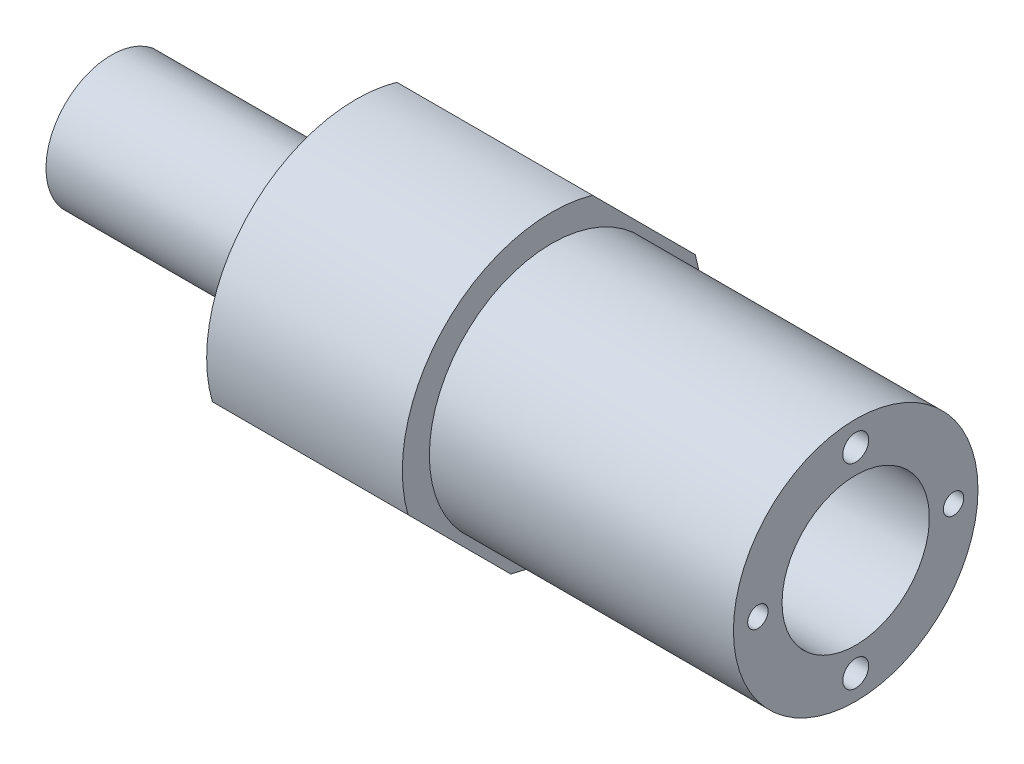
ISO-10303-21;
HEADER;
FILE_DESCRIPTION(('STEP AP214'),'2;1');
FILE_NAME('part.step','',(''),(''),'','','');
FILE_SCHEMA(('AUTOMOTIVE_DESIGN { 1 0 10303 214 1 1 1 1 }'));
ENDSEC;
DATA;
#1=APPLICATION_CONTEXT('core data for automotive mechanical design processes');
#2=APPLICATION_PROTOCOL_DEFINITION('international standard','automotive_design',2000,#1);
#3=PRODUCT_CONTEXT('',#1,'mechanical');
#4=PRODUCT('Part','Part','',(#3));
#5=PRODUCT_RELATED_PRODUCT_CATEGORY('part','',(#4));
#6=PRODUCT_DEFINITION_FORMATION('','',#4);
#7=PRODUCT_DEFINITION_CONTEXT('part definition',#1,'design');
#8=PRODUCT_DEFINITION('design','',#6,#7);
#9=PRODUCT_DEFINITION_SHAPE('','',#8);
#10=(LENGTH_UNIT() NAMED_UNIT(*) SI_UNIT(.MILLI.,.METRE.));
#11=(NAMED_UNIT(*) PLANE_ANGLE_UNIT() SI_UNIT($,.RADIAN.));
#12=(NAMED_UNIT(*) SI_UNIT($,.STERADIAN.) SOLID_ANGLE_UNIT());
#13=UNCERTAINTY_MEASURE_WITH_UNIT(LENGTH_MEASURE(1.E-05),#10,'distance_accuracy_value','');
#14=(GEOMETRIC_REPRESENTATION_CONTEXT(3) GLOBAL_UNCERTAINTY_ASSIGNED_CONTEXT((#13)) GLOBAL_UNIT_ASSIGNED_CONTEXT((#10,
#11,#12)) REPRESENTATION_CONTEXT('',''));
#15=CARTESIAN_POINT('',(0.,0.,0.));
#16=DIRECTION('',(0.,0.,1.));
#17=DIRECTION('',(1.,0.,0.));
#18=AXIS2_PLACEMENT_3D('',#15,#16,#17);
#19=CARTESIAN_POINT('',(227.370475165962,-148.573704322227,0.));
#20=DIRECTION('',(-1.,0.,0.));
#21=DIRECTION('',(0.,0.,1.));
#22=AXIS2_PLACEMENT_3D('',#19,#20,#21);
#23=CYLINDRICAL_SURFACE('',#22,18.3167356680549);
#24=DIRECTION('',(-1.,0.,0.));
#25=VECTOR('',#24,1.);
#26=CARTESIAN_POINT('',(227.370475165962,-130.955124471129,-5.00883714687244));
#27=LINE('',#26,#25);
#28=CARTESIAN_POINT('',(197.978559984911,-130.955124471129,-5.00883714687246));
#29=VERTEX_POINT('',#28);
#30=CARTESIAN_POINT('',(221.978559984911,-130.955124471129,-5.00883714687248));
#31=VERTEX_POINT('',#30);
#32=EDGE_CURVE('E11',#29,#31,#27,.F.);
#33=ORIENTED_EDGE('',*,*,#32,.F.);
#34=CARTESIAN_POINT('',(197.978559984911,-148.573704322227,0.));
#35=DIRECTION('',(-1.,0.,0.));
#36=DIRECTION('',(0.,0.,1.));
#37=AXIS2_PLACEMENT_3D('',#34,#35,#36);
#38=CIRCLE('',#37,18.3167356680549);
#39=CARTESIAN_POINT('',(197.978559984911,-153.582541469098,17.6185798510982));
#40=VERTEX_POINT('',#39);
#41=EDGE_CURVE('E174',#40,#29,#38,.T.);
#42=ORIENTED_EDGE('',*,*,#41,.F.);
#43=DIRECTION('',(-1.,0.,0.));
#44=VECTOR('',#43,1.);
#45=CARTESIAN_POINT('',(227.370475165962,-153.582541469098,17.6185798510982));
#46=LINE('',#45,#44);
#47=CARTESIAN_POINT('',(221.978559984911,-153.582541469098,17.6185798510982));
#48=VERTEX_POINT('',#47);
#49=EDGE_CURVE('E153',#48,#40,#46,.T.);
#50=ORIENTED_EDGE('',*,*,#49,.F.);
#51=CARTESIAN_POINT('',(221.978559984911,-148.573704322227,0.));
#52=DIRECTION('',(-1.,0.,0.));
#53=DIRECTION('',(0.,0.,1.));
#54=AXIS2_PLACEMENT_3D('',#51,#52,#53);
#55=CIRCLE('',#54,18.3167356680549);
#56=EDGE_CURVE('E180',#48,#31,#55,.T.);
#57=ORIENTED_EDGE('',*,*,#56,.T.);
#58=EDGE_LOOP('',(#33,#42,#50,#57));
#59=FACE_BOUND('',#58,.T.);
#60=ADVANCED_FACE('F35',(#59),#23,.T.);
#61=CARTESIAN_POINT('',(197.978559984911,0.,0.));
#62=DIRECTION('',(1.,0.,0.));
#63=DIRECTION('',(0.,0.,-1.));
#64=AXIS2_PLACEMENT_3D('',#61,#62,#63);
#65=PLANE('',#64);
#66=CARTESIAN_POINT('',(197.978559984911,-148.573704322227,-12.));
#67=DIRECTION('',(-1.,0.,0.));
#68=DIRECTION('',(0.,0.,1.));
#69=AXIS2_PLACEMENT_3D('',#66,#67,#68);
#70=CIRCLE('',#69,1.64999999999998);
#71=CARTESIAN_POINT('',(197.978559984911,-148.573704322227,-10.35));
#72=VERTEX_POINT('',#71);
#73=EDGE_CURVE('E245',#72,#72,#70,.T.);
#74=ORIENTED_EDGE('',*,*,#73,.F.);
#75=EDGE_LOOP('',(#74));
#76=FACE_BOUND('',#75,.T.);
#77=CARTESIAN_POINT('',(197.978559984911,-148.573704322227,12.));
#78=DIRECTION('',(-1.,0.,0.));
#79=DIRECTION('',(0.,0.,1.));
#80=AXIS2_PLACEMENT_3D('',#77,#78,#79);
#81=CIRCLE('',#80,1.64999999999998);
#82=CARTESIAN_POINT('',(197.978559984911,-148.573704322227,13.65));
#83=VERTEX_POINT('',#82);
#84=EDGE_CURVE('E262',#83,#83,#81,.T.);
#85=ORIENTED_EDGE('',*,*,#84,.F.);
#86=EDGE_LOOP('',(#85));
#87=FACE_BOUND('',#86,.T.);
#88=CARTESIAN_POINT('',(197.978559984911,-136.573704322227,0.));
#89=DIRECTION('',(1.,0.,0.));
#90=DIRECTION('',(0.,0.,-1.));
#91=AXIS2_PLACEMENT_3D('',#88,#89,#90);
#92=CIRCLE('',#91,1.5875);
#93=CARTESIAN_POINT('',(197.978559984911,-136.573704322227,-1.5875));
#94=VERTEX_POINT('',#93);
#95=EDGE_CURVE('E185',#94,#94,#92,.F.);
#96=ORIENTED_EDGE('',*,*,#95,.F.);
#97=EDGE_LOOP('',(#96));
#98=FACE_BOUND('',#97,.T.);
#99=CARTESIAN_POINT('',(197.978559984911,-160.573704322227,0.));
#100=DIRECTION('',(1.,0.,0.));
#101=DIRECTION('',(0.,0.,-1.));
#102=AXIS2_PLACEMENT_3D('',#99,#100,#101);
#103=CIRCLE('',#102,1.5875);
#104=CARTESIAN_POINT('',(197.978559984911,-160.573704322227,-1.5875));
#105=VERTEX_POINT('',#104);
#106=EDGE_CURVE('E187',#105,#105,#103,.F.);
#107=ORIENTED_EDGE('',*,*,#106,.F.);
#108=EDGE_LOOP('',(#107));
#109=FACE_BOUND('',#108,.T.);
#110=CARTESIAN_POINT('',(197.978559984911,-148.573704322227,0.));
#111=DIRECTION('',(-1.,0.,0.));
#112=DIRECTION('',(0.,0.,1.));
#113=AXIS2_PLACEMENT_3D('',#110,#111,#112);
#114=CIRCLE('',#113,8.02619764601481);
#115=CARTESIAN_POINT('',(197.978559984911,-143.488608741499,-6.20980286222918));
#116=VERTEX_POINT('',#115);
#117=CARTESIAN_POINT('',(197.978559984911,-142.363901459998,-5.08509558072846));
#118=VERTEX_POINT('',#117);
#119=EDGE_CURVE('E150',#116,#118,#114,.T.);
#120=ORIENTED_EDGE('',*,*,#119,.F.);
#121=CARTESIAN_POINT('',(197.978559984911,-142.987560750853,-5.58614357137373));
#122=DIRECTION('',(1.,0.,0.));
#123=DIRECTION('',(0.,0.,-1.));
#124=AXIS2_PLACEMENT_3D('',#121,#122,#123);
#125=CIRCLE('',#124,0.799999999999998);
#126=EDGE_CURVE('E294',#118,#116,#125,.F.);
#127=ORIENTED_EDGE('',*,*,#126,.F.);
#128=EDGE_LOOP('',(#120,#127));
#129=FACE_BOUND('',#128,.T.);
#130=ORIENTED_EDGE('',*,*,#41,.T.);
#131=DIRECTION('',(0.,0.707106781186583,0.707106781186511));
#132=VECTOR('',#131,1.);
#133=CARTESIAN_POINT('',(197.978559984911,-127.583420636013,-1.63713331175623));
#134=LINE('',#133,#132);
#135=CARTESIAN_POINT('',(197.978559984911,-143.564867175356,-17.6185798510982));
#136=VERTEX_POINT('',#135);
#137=EDGE_CURVE('E160',#136,#29,#134,.T.);
#138=ORIENTED_EDGE('',*,*,#137,.F.);
#139=CARTESIAN_POINT('',(197.978559984911,-166.192284173325,5.00883714687249));
#140=VERTEX_POINT('',#139);
#141=EDGE_CURVE('E172',#136,#140,#38,.T.);
#142=ORIENTED_EDGE('',*,*,#141,.T.);
#143=DIRECTION('',(0.,-0.707106781186583,-0.707106781186511));
#144=VECTOR('',#143,1.);
#145=CARTESIAN_POINT('',(197.978559984911,-147.131312046921,24.0698092732747));
#146=LINE('',#145,#144);
#147=EDGE_CURVE('E176',#40,#140,#146,.T.);
#148=ORIENTED_EDGE('',*,*,#147,.F.);
#149=EDGE_LOOP('',(#130,#138,#142,#148));
#150=FACE_BOUND('',#149,.T.);
#151=ADVANCED_FACE('F37',(#76,#87,#98,#109,#129,#150),#65,.F.);
#152=CARTESIAN_POINT('',(227.370475165962,-148.573704322227,0.));
#153=DIRECTION('',(-1.,0.,0.));
#154=DIRECTION('',(0.,0.,1.));
#155=AXIS2_PLACEMENT_3D('',#152,#153,#154);
#156=CYLINDRICAL_SURFACE('',#155,8.02619764601481);
#157=CARTESIAN_POINT('',(167.978559984911,-148.573704322227,0.));
#158=DIRECTION('',(-1.,0.,0.));
#159=DIRECTION('',(0.,0.,1.));
#160=AXIS2_PLACEMENT_3D('',#157,#158,#159);
#161=CIRCLE('',#160,8.02619764601481);
#162=CARTESIAN_POINT('',(167.978559984911,-143.488608741499,-6.20980286222918));
#163=VERTEX_POINT('',#162);
#164=CARTESIAN_POINT('',(167.978559984911,-142.363901459998,-5.08509558072844));
#165=VERTEX_POINT('',#164);
#166=EDGE_CURVE('E147',#163,#165,#161,.T.);
#167=ORIENTED_EDGE('',*,*,#166,.F.);
#168=DIRECTION('',(-1.,0.,0.));
#169=VECTOR('',#168,1.);
#170=CARTESIAN_POINT('',(182.978559984911,-143.488608741499,-6.20980286222918));
#171=LINE('',#170,#169);
#172=EDGE_CURVE('E50',#116,#163,#171,.T.);
#173=ORIENTED_EDGE('',*,*,#172,.F.);
#174=ORIENTED_EDGE('',*,*,#119,.T.);
#175=DIRECTION('',(-1.,0.,0.));
#176=VECTOR('',#175,1.);
#177=CARTESIAN_POINT('',(182.978559984911,-142.363901459998,-5.08509558072846));
#178=LINE('',#177,#176);
#179=EDGE_CURVE('E298',#165,#118,#178,.F.);
#180=ORIENTED_EDGE('',*,*,#179,.F.);
#181=EDGE_LOOP('',(#167,#173,#174,#180));
#182=FACE_BOUND('',#181,.T.);
#183=ADVANCED_FACE('F221',(#182),#156,.T.);
#184=CARTESIAN_POINT('',(167.978559984911,0.,0.));
#185=DIRECTION('',(-1.,0.,0.));
#186=DIRECTION('',(0.,0.,1.));
#187=AXIS2_PLACEMENT_3D('',#184,#185,#186);
#188=PLANE('',#187);
#189=CARTESIAN_POINT('',(167.978559984911,-142.987560750853,-5.58614357137373));
#190=DIRECTION('',(-1.,0.,0.));
#191=DIRECTION('',(0.,0.,1.));
#192=AXIS2_PLACEMENT_3D('',#189,#190,#191);
#193=CIRCLE('',#192,0.799999999999998);
#194=EDGE_CURVE('E302',#165,#163,#193,.F.);
#195=ORIENTED_EDGE('',*,*,#194,.T.);
#196=ORIENTED_EDGE('',*,*,#166,.T.);
#197=EDGE_LOOP('',(#195,#196));
#198=FACE_BOUND('',#197,.T.);
#199=CARTESIAN_POINT('',(167.978559984911,-148.573704322227,0.));
#200=DIRECTION('',(-1.,0.,0.));
#201=DIRECTION('',(0.,0.,1.));
#202=AXIS2_PLACEMENT_3D('',#199,#200,#201);
#203=CIRCLE('',#202,3.38357984470944);
#204=CARTESIAN_POINT('',(167.978559984911,-148.573704322227,3.38357984470944));
#205=VERTEX_POINT('',#204);
#206=EDGE_CURVE('E144',#205,#205,#203,.T.);
#207=ORIENTED_EDGE('',*,*,#206,.F.);
#208=EDGE_LOOP('',(#207));
#209=FACE_BOUND('',#208,.T.);
#210=ADVANCED_FACE('F450',(#198,#209),#188,.T.);
#211=CARTESIAN_POINT('',(227.370475165962,-148.573704322227,0.));
#212=DIRECTION('',(-1.,0.,0.));
#213=DIRECTION('',(0.,0.,1.));
#214=AXIS2_PLACEMENT_3D('',#211,#212,#213);
#215=CYLINDRICAL_SURFACE('',#214,3.38357984470944);
#216=ORIENTED_EDGE('',*,*,#206,.T.);
#217=EDGE_LOOP('',(#216));
#218=FACE_BOUND('',#217,.T.);
#219=CARTESIAN_POINT('',(205.151545348096,-148.573704322227,0.));
#220=DIRECTION('',(-1.,0.,0.));
#221=DIRECTION('',(0.,0.,1.));
#222=AXIS2_PLACEMENT_3D('',#219,#220,#221);
#223=CIRCLE('',#222,3.38357984470944);
#224=CARTESIAN_POINT('',(205.151545348096,-148.573704322227,3.38357984470944));
#225=VERTEX_POINT('',#224);
#226=EDGE_CURVE('E135',#225,#225,#223,.T.);
#227=ORIENTED_EDGE('',*,*,#226,.F.);
#228=EDGE_LOOP('',(#227));
#229=FACE_BOUND('',#228,.T.);
#230=ADVANCED_FACE('F456',(#218,#229),#215,.F.);
#231=CARTESIAN_POINT('',(205.151545348096,0.,0.));
#232=DIRECTION('',(-1.,0.,0.));
#233=DIRECTION('',(0.,0.,1.));
#234=AXIS2_PLACEMENT_3D('',#231,#232,#233);
#235=PLANE('',#234);
#236=CARTESIAN_POINT('',(205.151545348096,-148.573704322227,0.));
#237=DIRECTION('',(-1.,0.,0.));
#238=DIRECTION('',(0.,0.,1.));
#239=AXIS2_PLACEMENT_3D('',#236,#237,#238);
#240=CIRCLE('',#239,8.02619764601481);
#241=CARTESIAN_POINT('',(205.151545348096,-143.488608741499,-6.2098028622292));
#242=VERTEX_POINT('',#241);
#243=CARTESIAN_POINT('',(205.151545348096,-142.363901459998,-5.08509558072846));
#244=VERTEX_POINT('',#243);
#245=EDGE_CURVE('E129',#242,#244,#240,.T.);
#246=ORIENTED_EDGE('',*,*,#245,.F.);
#247=CARTESIAN_POINT('',(205.151545348096,-142.987560750853,-5.58614357137373));
#248=DIRECTION('',(-1.,0.,0.));
#249=DIRECTION('',(0.,0.,1.));
#250=AXIS2_PLACEMENT_3D('',#247,#248,#249);
#251=CIRCLE('',#250,0.799999999999998);
#252=EDGE_CURVE('E122',#244,#242,#251,.F.);
#253=ORIENTED_EDGE('',*,*,#252,.F.);
#254=EDGE_LOOP('',(#246,#253));
#255=FACE_BOUND('',#254,.T.);
#256=ORIENTED_EDGE('',*,*,#226,.T.);
#257=EDGE_LOOP('',(#256));
#258=FACE_BOUND('',#257,.T.);
#259=ADVANCED_FACE('F462',(#255,#258),#235,.F.);
#260=CARTESIAN_POINT('',(227.370475165962,-148.573704322227,0.));
#261=DIRECTION('',(-1.,0.,0.));
#262=DIRECTION('',(0.,0.,1.));
#263=AXIS2_PLACEMENT_3D('',#260,#261,#262);
#264=CYLINDRICAL_SURFACE('',#263,8.02619764601481);
#265=CARTESIAN_POINT('',(208.579017697369,-148.573704322227,0.));
#266=DIRECTION('',(-1.,0.,0.));
#267=DIRECTION('',(0.,0.,1.));
#268=AXIS2_PLACEMENT_3D('',#265,#266,#267);
#269=CIRCLE('',#268,8.02619764601481);
#270=CARTESIAN_POINT('',(208.579017697369,-143.488608741499,-6.2098028622292));
#271=VERTEX_POINT('',#270);
#272=CARTESIAN_POINT('',(208.579017697369,-142.363901459998,-5.08509558072846));
#273=VERTEX_POINT('',#272);
#274=EDGE_CURVE('E127',#271,#273,#269,.T.);
#275=ORIENTED_EDGE('',*,*,#274,.F.);
#276=DIRECTION('',(-1.,0.,0.));
#277=VECTOR('',#276,1.);
#278=CARTESIAN_POINT('',(206.865281522732,-143.488608741499,-6.20980286222918));
#279=LINE('',#278,#277);
#280=EDGE_CURVE('E58',#242,#271,#279,.F.);
#281=ORIENTED_EDGE('',*,*,#280,.F.);
#282=ORIENTED_EDGE('',*,*,#245,.T.);
#283=DIRECTION('',(-1.,0.,0.));
#284=VECTOR('',#283,1.);
#285=CARTESIAN_POINT('',(206.865281522732,-142.363901459998,-5.08509558072846));
#286=LINE('',#285,#284);
#287=EDGE_CURVE('E117',#273,#244,#286,.T.);
#288=ORIENTED_EDGE('',*,*,#287,.F.);
#289=EDGE_LOOP('',(#275,#281,#282,#288));
#290=FACE_BOUND('',#289,.T.);
#291=ADVANCED_FACE('F126',(#290),#264,.F.);
#292=CARTESIAN_POINT('',(208.579017697369,0.,0.));
#293=DIRECTION('',(1.,0.,0.));
#294=DIRECTION('',(0.,0.,-1.));
#295=AXIS2_PLACEMENT_3D('',#292,#293,#294);
#296=PLANE('',#295);
#297=CARTESIAN_POINT('',(208.579017697369,-142.987560750853,-5.58614357137373));
#298=DIRECTION('',(1.,0.,0.));
#299=DIRECTION('',(0.,0.,-1.));
#300=AXIS2_PLACEMENT_3D('',#297,#298,#299);
#301=CIRCLE('',#300,0.799999999999998);
#302=EDGE_CURVE('E114',#271,#273,#301,.T.);
#303=ORIENTED_EDGE('',*,*,#302,.F.);
#304=ORIENTED_EDGE('',*,*,#274,.T.);
#305=EDGE_LOOP('',(#303,#304));
#306=FACE_BOUND('',#305,.T.);
#307=CARTESIAN_POINT('',(208.579017697369,-148.573704322227,0.));
#308=DIRECTION('',(-1.,0.,0.));
#309=DIRECTION('',(0.,0.,1.));
#310=AXIS2_PLACEMENT_3D('',#307,#308,#309);
#311=CIRCLE('',#310,9.03625830127785);
#312=CARTESIAN_POINT('',(208.579017697369,-148.573704322227,9.03625830127785));
#313=VERTEX_POINT('',#312);
#314=EDGE_CURVE('E133',#313,#313,#311,.T.);
#315=ORIENTED_EDGE('',*,*,#314,.F.);
#316=EDGE_LOOP('',(#315));
#317=FACE_BOUND('',#316,.T.);
#318=ADVANCED_FACE('F131',(#306,#317),#296,.T.);
#319=CARTESIAN_POINT('',(227.370475165962,-148.573704322227,0.));
#320=DIRECTION('',(-1.,0.,0.));
#321=DIRECTION('',(0.,0.,1.));
#322=AXIS2_PLACEMENT_3D('',#319,#320,#321);
#323=CYLINDRICAL_SURFACE('',#322,9.03625830127785);
#324=ORIENTED_EDGE('',*,*,#314,.T.);
#325=EDGE_LOOP('',(#324));
#326=FACE_BOUND('',#325,.T.);
#327=CARTESIAN_POINT('',(259.278559984911,-148.573704322227,0.));
#328=DIRECTION('',(-1.,0.,0.));
#329=DIRECTION('',(0.,0.,1.));
#330=AXIS2_PLACEMENT_3D('',#327,#328,#329);
#331=CIRCLE('',#330,9.03625830127785);
#332=CARTESIAN_POINT('',(259.278559984911,-148.573704322227,9.03625830127785));
#333=VERTEX_POINT('',#332);
#334=EDGE_CURVE('E138',#333,#333,#331,.T.);
#335=ORIENTED_EDGE('',*,*,#334,.F.);
#336=EDGE_LOOP('',(#335));
#337=FACE_BOUND('',#336,.T.);
#338=ADVANCED_FACE('F201',(#326,#337),#323,.F.);
#339=CARTESIAN_POINT('',(259.278559984911,0.,0.));
#340=DIRECTION('',(1.,0.,0.));
#341=DIRECTION('',(0.,0.,-1.));
#342=AXIS2_PLACEMENT_3D('',#339,#340,#341);
#343=PLANE('',#342);
#344=CARTESIAN_POINT('',(259.278559984911,-148.573704322227,12.));
#345=DIRECTION('',(1.,0.,0.));
#346=DIRECTION('',(0.,0.,-1.));
#347=AXIS2_PLACEMENT_3D('',#344,#345,#346);
#348=CIRCLE('',#347,1.25);
#349=CARTESIAN_POINT('',(259.278559984911,-148.573704322227,10.75));
#350=VERTEX_POINT('',#349);
#351=EDGE_CURVE('E268',#350,#350,#348,.T.);
#352=ORIENTED_EDGE('',*,*,#351,.F.);
#353=EDGE_LOOP('',(#352));
#354=FACE_BOUND('',#353,.T.);
#355=CARTESIAN_POINT('',(259.278559984911,-148.573704322227,-12.));
#356=DIRECTION('',(1.,0.,0.));
#357=DIRECTION('',(0.,0.,-1.));
#358=AXIS2_PLACEMENT_3D('',#355,#356,#357);
#359=CIRCLE('',#358,1.25);
#360=CARTESIAN_POINT('',(259.278559984911,-148.573704322227,-13.25));
#361=VERTEX_POINT('',#360);
#362=EDGE_CURVE('E274',#361,#361,#359,.T.);
#363=ORIENTED_EDGE('',*,*,#362,.F.);
#364=EDGE_LOOP('',(#363));
#365=FACE_BOUND('',#364,.T.);
#366=CARTESIAN_POINT('',(259.278559984911,-136.573704322227,0.));
#367=DIRECTION('',(1.,0.,0.));
#368=DIRECTION('',(0.,0.,-1.));
#369=AXIS2_PLACEMENT_3D('',#366,#367,#368);
#370=CIRCLE('',#369,1.5875);
#371=CARTESIAN_POINT('',(259.278559984911,-136.573704322227,-1.5875));
#372=VERTEX_POINT('',#371);
#373=EDGE_CURVE('E281',#372,#372,#370,.T.);
#374=ORIENTED_EDGE('',*,*,#373,.F.);
#375=EDGE_LOOP('',(#374));
#376=FACE_BOUND('',#375,.T.);
#377=CARTESIAN_POINT('',(259.278559984911,-160.573704322227,0.));
#378=DIRECTION('',(1.,0.,0.));
#379=DIRECTION('',(0.,0.,-1.));
#380=AXIS2_PLACEMENT_3D('',#377,#378,#379);
#381=CIRCLE('',#380,1.5875);
#382=CARTESIAN_POINT('',(259.278559984911,-160.573704322227,-1.5875));
#383=VERTEX_POINT('',#382);
#384=EDGE_CURVE('E280',#383,#383,#381,.T.);
#385=ORIENTED_EDGE('',*,*,#384,.F.);
#386=EDGE_LOOP('',(#385));
#387=FACE_BOUND('',#386,.T.);
#388=ORIENTED_EDGE('',*,*,#334,.T.);
#389=EDGE_LOOP('',(#388));
#390=FACE_BOUND('',#389,.T.);
#391=CARTESIAN_POINT('',(259.278559984911,-148.573704322227,0.));
#392=DIRECTION('',(-1.,0.,0.));
#393=DIRECTION('',(0.,0.,1.));
#394=AXIS2_PLACEMENT_3D('',#391,#392,#393);
#395=CIRCLE('',#394,15.);
#396=CARTESIAN_POINT('',(259.278559984911,-148.573704322227,15.));
#397=VERTEX_POINT('',#396);
#398=EDGE_CURVE('E193',#397,#397,#395,.T.);
#399=ORIENTED_EDGE('',*,*,#398,.F.);
#400=EDGE_LOOP('',(#399));
#401=FACE_BOUND('',#400,.T.);
#402=ADVANCED_FACE('F198',(#354,#365,#376,#387,#390,#401),#343,.T.);
#403=CARTESIAN_POINT('',(227.370475165962,-148.573704322227,0.));
#404=DIRECTION('',(-1.,0.,0.));
#405=DIRECTION('',(0.,0.,1.));
#406=AXIS2_PLACEMENT_3D('',#403,#404,#405);
#407=CYLINDRICAL_SURFACE('',#406,15.);
#408=ORIENTED_EDGE('',*,*,#398,.T.);
#409=EDGE_LOOP('',(#408));
#410=FACE_BOUND('',#409,.T.);
#411=CARTESIAN_POINT('',(221.978559984911,-148.573704322227,0.));
#412=DIRECTION('',(-1.,0.,0.));
#413=DIRECTION('',(0.,0.,1.));
#414=AXIS2_PLACEMENT_3D('',#411,#412,#413);
#415=CIRCLE('',#414,15.);
#416=CARTESIAN_POINT('',(221.978559984911,-148.573704322227,15.));
#417=VERTEX_POINT('',#416);
#418=EDGE_CURVE('E190',#417,#417,#415,.T.);
#419=ORIENTED_EDGE('',*,*,#418,.F.);
#420=EDGE_LOOP('',(#419));
#421=FACE_BOUND('',#420,.T.);
#422=ADVANCED_FACE('F209',(#410,#421),#407,.T.);
#423=CARTESIAN_POINT('',(221.978559984911,0.,0.));
#424=DIRECTION('',(1.,0.,0.));
#425=DIRECTION('',(0.,0.,-1.));
#426=AXIS2_PLACEMENT_3D('',#423,#424,#425);
#427=PLANE('',#426);
#428=DIRECTION('',(0.,-0.707106781186584,-0.707106781186511));
#429=VECTOR('',#428,1.);
#430=CARTESIAN_POINT('',(221.978559984911,-62.9731436621218,62.9731436621282));
#431=LINE('',#430,#429);
#432=CARTESIAN_POINT('',(221.978559984911,-143.564867175356,-17.6185798510982));
#433=VERTEX_POINT('',#432);
#434=EDGE_CURVE('E163',#31,#433,#431,.T.);
#435=ORIENTED_EDGE('',*,*,#434,.F.);
#436=ORIENTED_EDGE('',*,*,#56,.F.);
#437=DIRECTION('',(0.,0.707106781186584,0.707106781186512));
#438=VECTOR('',#437,1.);
#439=CARTESIAN_POINT('',(221.978559984911,-85.6005606600902,85.6005606600989));
#440=LINE('',#439,#438);
#441=CARTESIAN_POINT('',(221.978559984911,-166.192284173325,5.00883714687248));
#442=VERTEX_POINT('',#441);
#443=EDGE_CURVE('E175',#442,#48,#440,.T.);
#444=ORIENTED_EDGE('',*,*,#443,.F.);
#445=EDGE_CURVE('E183',#433,#442,#55,.T.);
#446=ORIENTED_EDGE('',*,*,#445,.F.);
#447=EDGE_LOOP('',(#435,#436,#444,#446));
#448=FACE_BOUND('',#447,.T.);
#449=ORIENTED_EDGE('',*,*,#418,.T.);
#450=EDGE_LOOP('',(#449));
#451=FACE_BOUND('',#450,.T.);
#452=ADVANCED_FACE('F227',(#448,#451),#427,.T.);
#453=DIRECTION('',(-1.,0.,0.));
#454=VECTOR('',#453,1.);
#455=CARTESIAN_POINT('',(227.370475165962,-143.564867175356,-17.6185798510982));
#456=LINE('',#455,#454);
#457=EDGE_CURVE('E43',#433,#136,#456,.T.);
#458=ORIENTED_EDGE('',*,*,#457,.F.);
#459=ORIENTED_EDGE('',*,*,#445,.T.);
#460=DIRECTION('',(-1.,0.,0.));
#461=VECTOR('',#460,1.);
#462=CARTESIAN_POINT('',(227.370475165962,-166.192284173325,5.00883714687249));
#463=LINE('',#462,#461);
#464=EDGE_CURVE('E155',#140,#442,#463,.F.);
#465=ORIENTED_EDGE('',*,*,#464,.F.);
#466=ORIENTED_EDGE('',*,*,#141,.F.);
#467=EDGE_LOOP('',(#458,#459,#465,#466));
#468=FACE_BOUND('',#467,.T.);
#469=ADVANCED_FACE('F179',(#468),#23,.T.);
#470=CARTESIAN_POINT('',(167.977559984911,-160.573704322227,0.));
#471=DIRECTION('',(1.,0.,0.));
#472=DIRECTION('',(0.,0.,-1.));
#473=AXIS2_PLACEMENT_3D('',#470,#471,#472);
#474=CYLINDRICAL_SURFACE('',#473,1.5875);
#475=ORIENTED_EDGE('',*,*,#384,.T.);
#476=EDGE_LOOP('',(#475));
#477=FACE_BOUND('',#476,.T.);
#478=ORIENTED_EDGE('',*,*,#106,.T.);
#479=EDGE_LOOP('',(#478));
#480=FACE_BOUND('',#479,.T.);
#481=ADVANCED_FACE('F226',(#477,#480),#474,.F.);
#482=CARTESIAN_POINT('',(167.977559984911,-136.573704322227,0.));
#483=DIRECTION('',(1.,0.,0.));
#484=DIRECTION('',(0.,0.,-1.));
#485=AXIS2_PLACEMENT_3D('',#482,#483,#484);
#486=CYLINDRICAL_SURFACE('',#485,1.5875);
#487=ORIENTED_EDGE('',*,*,#373,.T.);
#488=EDGE_LOOP('',(#487));
#489=FACE_BOUND('',#488,.T.);
#490=ORIENTED_EDGE('',*,*,#95,.T.);
#491=EDGE_LOOP('',(#490));
#492=FACE_BOUND('',#491,.T.);
#493=ADVANCED_FACE('F232',(#489,#492),#486,.F.);
#494=CARTESIAN_POINT('',(253.278559984911,-148.573704322227,-12.));
#495=DIRECTION('',(1.,0.,0.));
#496=DIRECTION('',(0.,0.,-1.));
#497=AXIS2_PLACEMENT_3D('',#494,#495,#496);
#498=CONICAL_SURFACE('',#497,1.25,1.02974425867664);
#499=CARTESIAN_POINT('',(252.527484211127,-148.573704322227,-12.));
#500=VERTEX_POINT('',#499);
#501=VERTEX_LOOP('',#500);
#502=FACE_BOUND('',#501,.T.);
#503=CARTESIAN_POINT('',(253.278559984911,-148.573704322227,-12.));
#504=DIRECTION('',(1.,0.,0.));
#505=DIRECTION('',(0.,0.,-1.));
#506=AXIS2_PLACEMENT_3D('',#503,#504,#505);
#507=CIRCLE('',#506,1.25);
#508=CARTESIAN_POINT('',(253.278559984911,-148.573704322227,-13.25));
#509=VERTEX_POINT('',#508);
#510=EDGE_CURVE('E277',#509,#509,#507,.T.);
#511=ORIENTED_EDGE('',*,*,#510,.T.);
#512=EDGE_LOOP('',(#511));
#513=FACE_BOUND('',#512,.T.);
#514=ADVANCED_FACE('F356',(#502,#513),#498,.F.);
#515=CARTESIAN_POINT('',(259.278559984911,-148.573704322227,-12.));
#516=DIRECTION('',(1.,0.,0.));
#517=DIRECTION('',(0.,0.,-1.));
#518=AXIS2_PLACEMENT_3D('',#515,#516,#517);
#519=CYLINDRICAL_SURFACE('',#518,1.25);
#520=ORIENTED_EDGE('',*,*,#510,.F.);
#521=EDGE_LOOP('',(#520));
#522=FACE_BOUND('',#521,.T.);
#523=ORIENTED_EDGE('',*,*,#362,.T.);
#524=EDGE_LOOP('',(#523));
#525=FACE_BOUND('',#524,.T.);
#526=ADVANCED_FACE('F352',(#522,#525),#519,.F.);
#527=CARTESIAN_POINT('',(253.278559984911,-148.573704322227,12.));
#528=DIRECTION('',(1.,0.,0.));
#529=DIRECTION('',(0.,0.,-1.));
#530=AXIS2_PLACEMENT_3D('',#527,#528,#529);
#531=CONICAL_SURFACE('',#530,1.25,1.02974425867664);
#532=CARTESIAN_POINT('',(252.527484211127,-148.573704322227,12.));
#533=VERTEX_POINT('',#532);
#534=VERTEX_LOOP('',#533);
#535=FACE_BOUND('',#534,.T.);
#536=CARTESIAN_POINT('',(253.278559984911,-148.573704322227,12.));
#537=DIRECTION('',(1.,0.,0.));
#538=DIRECTION('',(0.,0.,-1.));
#539=AXIS2_PLACEMENT_3D('',#536,#537,#538);
#540=CIRCLE('',#539,1.25);
#541=CARTESIAN_POINT('',(253.278559984911,-148.573704322227,10.75));
#542=VERTEX_POINT('',#541);
#543=EDGE_CURVE('E271',#542,#542,#540,.T.);
#544=ORIENTED_EDGE('',*,*,#543,.T.);
#545=EDGE_LOOP('',(#544));
#546=FACE_BOUND('',#545,.T.);
#547=ADVANCED_FACE('F348',(#535,#546),#531,.F.);
#548=CARTESIAN_POINT('',(259.278559984911,-148.573704322227,12.));
#549=DIRECTION('',(1.,0.,0.));
#550=DIRECTION('',(0.,0.,-1.));
#551=AXIS2_PLACEMENT_3D('',#548,#549,#550);
#552=CYLINDRICAL_SURFACE('',#551,1.25);
#553=ORIENTED_EDGE('',*,*,#543,.F.);
#554=EDGE_LOOP('',(#553));
#555=FACE_BOUND('',#554,.T.);
#556=ORIENTED_EDGE('',*,*,#351,.T.);
#557=EDGE_LOOP('',(#556));
#558=FACE_BOUND('',#557,.T.);
#559=ADVANCED_FACE('F344',(#555,#558),#552,.F.);
#560=CARTESIAN_POINT('',(207.978559984911,-148.573704322227,12.));
#561=DIRECTION('',(-1.,0.,0.));
#562=DIRECTION('',(0.,0.,1.));
#563=AXIS2_PLACEMENT_3D('',#560,#561,#562);
#564=CONICAL_SURFACE('',#563,1.64999999999998,1.02974425867666);
#565=CARTESIAN_POINT('',(208.969980006307,-148.573704322227,12.));
#566=VERTEX_POINT('',#565);
#567=VERTEX_LOOP('',#566);
#568=FACE_BOUND('',#567,.T.);
#569=CARTESIAN_POINT('',(207.978559984911,-148.573704322227,12.));
#570=DIRECTION('',(-1.,0.,0.));
#571=DIRECTION('',(0.,0.,1.));
#572=AXIS2_PLACEMENT_3D('',#569,#570,#571);
#573=CIRCLE('',#572,1.64999999999998);
#574=CARTESIAN_POINT('',(207.978559984911,-148.573704322227,13.65));
#575=VERTEX_POINT('',#574);
#576=EDGE_CURVE('E265',#575,#575,#573,.T.);
#577=ORIENTED_EDGE('',*,*,#576,.T.);
#578=EDGE_LOOP('',(#577));
#579=FACE_BOUND('',#578,.T.);
#580=ADVANCED_FACE('F340',(#568,#579),#564,.F.);
#581=CARTESIAN_POINT('',(197.978559984911,-148.573704322227,12.));
#582=DIRECTION('',(-1.,0.,0.));
#583=DIRECTION('',(0.,0.,1.));
#584=AXIS2_PLACEMENT_3D('',#581,#582,#583);
#585=CYLINDRICAL_SURFACE('',#584,1.64999999999998);
#586=ORIENTED_EDGE('',*,*,#576,.F.);
#587=EDGE_LOOP('',(#586));
#588=FACE_BOUND('',#587,.T.);
#589=ORIENTED_EDGE('',*,*,#84,.T.);
#590=EDGE_LOOP('',(#589));
#591=FACE_BOUND('',#590,.T.);
#592=ADVANCED_FACE('F336',(#588,#591),#585,.F.);
#593=CARTESIAN_POINT('',(207.978559984911,-148.573704322227,-12.));
#594=DIRECTION('',(-1.,0.,0.));
#595=DIRECTION('',(0.,0.,1.));
#596=AXIS2_PLACEMENT_3D('',#593,#594,#595);
#597=CONICAL_SURFACE('',#596,1.64999999999998,1.02974425867666);
#598=CARTESIAN_POINT('',(208.969980006307,-148.573704322227,-12.));
#599=VERTEX_POINT('',#598);
#600=VERTEX_LOOP('',#599);
#601=FACE_BOUND('',#600,.T.);
#602=CARTESIAN_POINT('',(207.978559984911,-148.573704322227,-12.));
#603=DIRECTION('',(-1.,0.,0.));
#604=DIRECTION('',(0.,0.,1.));
#605=AXIS2_PLACEMENT_3D('',#602,#603,#604);
#606=CIRCLE('',#605,1.64999999999998);
#607=CARTESIAN_POINT('',(207.978559984911,-148.573704322227,-10.35));
#608=VERTEX_POINT('',#607);
#609=EDGE_CURVE('E259',#608,#608,#606,.T.);
#610=ORIENTED_EDGE('',*,*,#609,.T.);
#611=EDGE_LOOP('',(#610));
#612=FACE_BOUND('',#611,.T.);
#613=ADVANCED_FACE('F332',(#601,#612),#597,.F.);
#614=CARTESIAN_POINT('',(197.978559984911,-148.573704322227,-12.));
#615=DIRECTION('',(-1.,0.,0.));
#616=DIRECTION('',(0.,0.,1.));
#617=AXIS2_PLACEMENT_3D('',#614,#615,#616);
#618=CYLINDRICAL_SURFACE('',#617,1.64999999999998);
#619=ORIENTED_EDGE('',*,*,#609,.F.);
#620=EDGE_LOOP('',(#619));
#621=FACE_BOUND('',#620,.T.);
#622=ORIENTED_EDGE('',*,*,#73,.T.);
#623=EDGE_LOOP('',(#622));
#624=FACE_BOUND('',#623,.T.);
#625=ADVANCED_FACE('F325',(#621,#624),#618,.F.);
#626=CARTESIAN_POINT('',(227.978559984911,-147.131312046921,24.0698092732747));
#627=DIRECTION('',(0.,0.707106781186511,-0.707106781186583));
#628=DIRECTION('',(0.,0.707106781186584,0.707106781186512));
#629=AXIS2_PLACEMENT_3D('',#626,#627,#628);
#630=PLANE('',#629);
#631=CARTESIAN_POINT('',(209.978559984911,-159.887412821211,11.3137084989853));
#632=DIRECTION('',(0.,-0.707106781186511,0.707106781186584));
#633=DIRECTION('',(0.,-0.707106781186584,-0.707106781186511));
#634=AXIS2_PLACEMENT_3D('',#631,#632,#633);
#635=CIRCLE('',#634,2.09999999999999);
#636=CARTESIAN_POINT('',(209.978559984911,-161.372337061703,9.82878425849366));
#637=VERTEX_POINT('',#636);
#638=EDGE_CURVE('E300',#637,#637,#635,.T.);
#639=ORIENTED_EDGE('',*,*,#638,.F.);
#640=EDGE_LOOP('',(#639));
#641=FACE_BOUND('',#640,.T.);
#642=ORIENTED_EDGE('',*,*,#464,.T.);
#643=ORIENTED_EDGE('',*,*,#443,.T.);
#644=ORIENTED_EDGE('',*,*,#49,.T.);
#645=ORIENTED_EDGE('',*,*,#147,.T.);
#646=EDGE_LOOP('',(#642,#643,#644,#645));
#647=FACE_BOUND('',#646,.T.);
#648=ADVANCED_FACE('F249',(#641,#647),#630,.F.);
#649=CARTESIAN_POINT('',(227.978559984911,-127.583420636013,-1.63713331175623));
#650=DIRECTION('',(0.,-0.707106781186511,0.707106781186583));
#651=DIRECTION('',(0.,-0.707106781186584,-0.707106781186511));
#652=AXIS2_PLACEMENT_3D('',#649,#650,#651);
#653=PLANE('',#652);
#654=CARTESIAN_POINT('',(209.978559984911,-137.259995823243,-11.3137084989853));
#655=DIRECTION('',(0.,0.707106781186511,-0.707106781186584));
#656=DIRECTION('',(0.,0.707106781186584,0.707106781186511));
#657=AXIS2_PLACEMENT_3D('',#654,#655,#656);
#658=CIRCLE('',#657,2.09999999999999);
#659=CARTESIAN_POINT('',(209.978559984911,-135.775071582751,-9.82878425849366));
#660=VERTEX_POINT('',#659);
#661=EDGE_CURVE('E253',#660,#660,#658,.T.);
#662=ORIENTED_EDGE('',*,*,#661,.F.);
#663=EDGE_LOOP('',(#662));
#664=FACE_BOUND('',#663,.T.);
#665=ORIENTED_EDGE('',*,*,#32,.T.);
#666=ORIENTED_EDGE('',*,*,#434,.T.);
#667=ORIENTED_EDGE('',*,*,#457,.T.);
#668=ORIENTED_EDGE('',*,*,#137,.T.);
#669=EDGE_LOOP('',(#665,#666,#667,#668));
#670=FACE_BOUND('',#669,.T.);
#671=ADVANCED_FACE('F159',(#664,#670),#653,.F.);
#672=CARTESIAN_POINT('',(209.978559984911,-140.088422947989,-8.485281374239));
#673=DIRECTION('',(0.,0.707106781186511,-0.707106781186584));
#674=DIRECTION('',(0.,0.707106781186584,0.707106781186511));
#675=AXIS2_PLACEMENT_3D('',#672,#673,#674);
#676=CONICAL_SURFACE('',#675,2.09999999999999,1.02974425867665);
#677=CARTESIAN_POINT('',(209.978559984911,-140.98065544634,-7.59304887588805));
#678=VERTEX_POINT('',#677);
#679=VERTEX_LOOP('',#678);
#680=FACE_BOUND('',#679,.T.);
#681=CARTESIAN_POINT('',(209.978559984911,-140.088422947989,-8.485281374239));
#682=DIRECTION('',(0.,0.707106781186511,-0.707106781186584));
#683=DIRECTION('',(0.,0.707106781186584,0.707106781186511));
#684=AXIS2_PLACEMENT_3D('',#681,#682,#683);
#685=CIRCLE('',#684,2.09999999999999);
#686=CARTESIAN_POINT('',(209.978559984911,-138.603498707497,-7.00035713374733));
#687=VERTEX_POINT('',#686);
#688=EDGE_CURVE('E250',#687,#687,#685,.T.);
#689=ORIENTED_EDGE('',*,*,#688,.T.);
#690=EDGE_LOOP('',(#689));
#691=FACE_BOUND('',#690,.T.);
#692=ADVANCED_FACE('F317',(#680,#691),#676,.F.);
#693=CARTESIAN_POINT('',(209.978559984911,-137.259995823243,-11.3137084989853));
#694=DIRECTION('',(0.,0.707106781186511,-0.707106781186584));
#695=DIRECTION('',(0.,0.707106781186584,0.707106781186511));
#696=AXIS2_PLACEMENT_3D('',#693,#694,#695);
#697=CYLINDRICAL_SURFACE('',#696,2.09999999999999);
#698=ORIENTED_EDGE('',*,*,#688,.F.);
#699=EDGE_LOOP('',(#698));
#700=FACE_BOUND('',#699,.T.);
#701=ORIENTED_EDGE('',*,*,#661,.T.);
#702=EDGE_LOOP('',(#701));
#703=FACE_BOUND('',#702,.T.);
#704=ADVANCED_FACE('F314',(#700,#703),#697,.F.);
#705=CARTESIAN_POINT('',(209.978559984911,-157.058985696465,8.485281374239));
#706=DIRECTION('',(0.,-0.707106781186511,0.707106781186584));
#707=DIRECTION('',(0.,-0.707106781186584,-0.707106781186511));
#708=AXIS2_PLACEMENT_3D('',#705,#706,#707);
#709=CONICAL_SURFACE('',#708,2.09999999999999,1.02974425867665);
#710=CARTESIAN_POINT('',(209.978559984911,-156.166753198114,7.59304887588805));
#711=VERTEX_POINT('',#710);
#712=VERTEX_LOOP('',#711);
#713=FACE_BOUND('',#712,.T.);
#714=CARTESIAN_POINT('',(209.978559984911,-157.058985696465,8.485281374239));
#715=DIRECTION('',(0.,-0.707106781186511,0.707106781186584));
#716=DIRECTION('',(0.,-0.707106781186584,-0.707106781186511));
#717=AXIS2_PLACEMENT_3D('',#714,#715,#716);
#718=CIRCLE('',#717,2.09999999999999);
#719=CARTESIAN_POINT('',(209.978559984911,-158.543909936957,7.00035713374733));
#720=VERTEX_POINT('',#719);
#721=EDGE_CURVE('E308',#720,#720,#718,.T.);
#722=ORIENTED_EDGE('',*,*,#721,.T.);
#723=EDGE_LOOP('',(#722));
#724=FACE_BOUND('',#723,.T.);
#725=ADVANCED_FACE('F422',(#713,#724),#709,.F.);
#726=CARTESIAN_POINT('',(209.978559984911,-159.887412821211,11.3137084989853));
#727=DIRECTION('',(0.,-0.707106781186511,0.707106781186584));
#728=DIRECTION('',(0.,-0.707106781186584,-0.707106781186511));
#729=AXIS2_PLACEMENT_3D('',#726,#727,#728);
#730=CYLINDRICAL_SURFACE('',#729,2.09999999999999);
#731=ORIENTED_EDGE('',*,*,#721,.F.);
#732=EDGE_LOOP('',(#731));
#733=FACE_BOUND('',#732,.T.);
#734=ORIENTED_EDGE('',*,*,#638,.T.);
#735=EDGE_LOOP('',(#734));
#736=FACE_BOUND('',#735,.T.);
#737=ADVANCED_FACE('F427',(#733,#736),#730,.F.);
#738=CARTESIAN_POINT('',(167.977559984911,-142.987560750853,-5.58614357137373));
#739=DIRECTION('',(1.,0.,0.));
#740=DIRECTION('',(0.,0.,-1.));
#741=AXIS2_PLACEMENT_3D('',#738,#739,#740);
#742=CYLINDRICAL_SURFACE('',#741,0.799999999999998);
#743=ORIENTED_EDGE('',*,*,#280,.T.);
#744=ORIENTED_EDGE('',*,*,#302,.T.);
#745=ORIENTED_EDGE('',*,*,#287,.T.);
#746=ORIENTED_EDGE('',*,*,#252,.T.);
#747=EDGE_LOOP('',(#743,#744,#745,#746));
#748=FACE_BOUND('',#747,.T.);
#749=ORIENTED_EDGE('',*,*,#126,.T.);
#750=ORIENTED_EDGE('',*,*,#172,.T.);
#751=ORIENTED_EDGE('',*,*,#194,.F.);
#752=ORIENTED_EDGE('',*,*,#179,.T.);
#753=EDGE_LOOP('',(#749,#750,#751,#752));
#754=FACE_BOUND('',#753,.T.);
#755=ADVANCED_FACE('F116',(#748,#754),#742,.F.);
#756=CLOSED_SHELL('',(#60,#151,#183,#210,#230,#259,#291,#318,#338,#402,#422,#452,#469,#481,#493,
#514,#526,#547,#559,#580,#592,#613,#625,#648,#671,#692,#704,#725,#737,#755));
#757=MANIFOLD_SOLID_BREP('B2',#756);
#758=ADVANCED_BREP_SHAPE_REPRESENTATION('',(#18,#757),#14);
#759=SHAPE_DEFINITION_REPRESENTATION(#9,#758);
ENDSEC;
END-ISO-10303-21;
